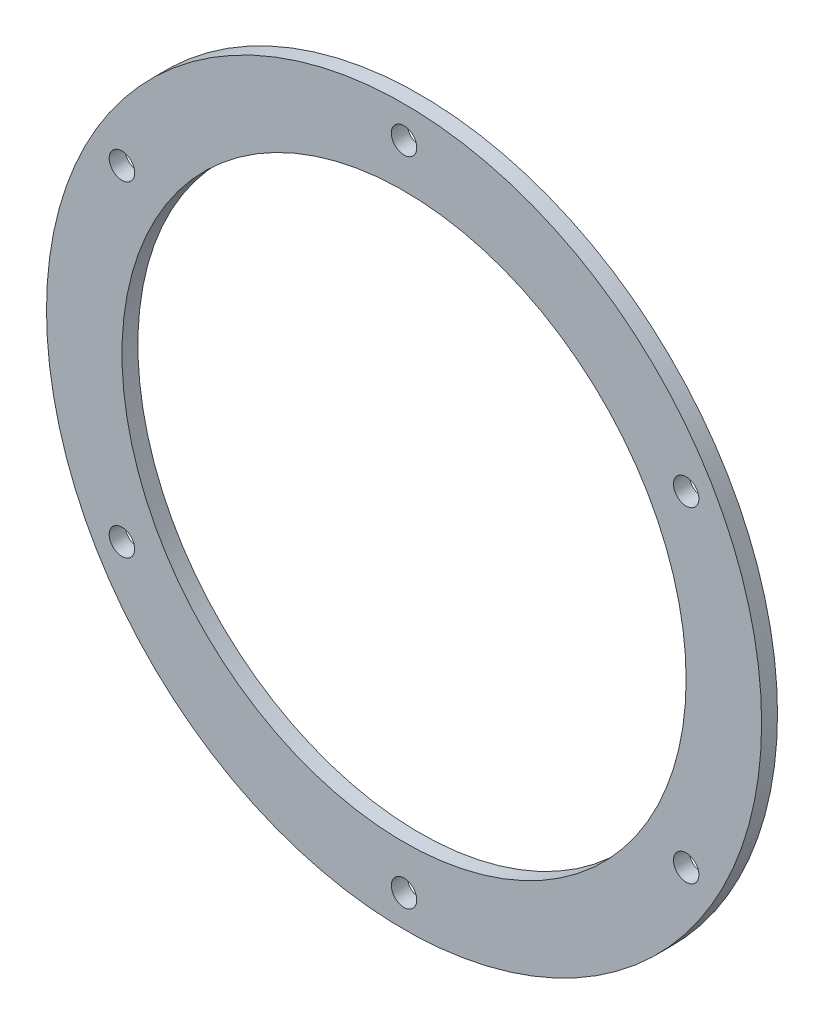
ISO-10303-21;
HEADER;
FILE_DESCRIPTION(('STEP AP214'),'2;1');
FILE_NAME('part.step','',(''),(''),'','','');
FILE_SCHEMA(('AUTOMOTIVE_DESIGN { 1 0 10303 214 1 1 1 1 }'));
ENDSEC;
DATA;
#1=APPLICATION_CONTEXT('core data for automotive mechanical design processes');
#2=APPLICATION_PROTOCOL_DEFINITION('international standard','automotive_design',2000,#1);
#3=PRODUCT_CONTEXT('',#1,'mechanical');
#4=PRODUCT('Part','Part','',(#3));
#5=PRODUCT_RELATED_PRODUCT_CATEGORY('part','',(#4));
#6=PRODUCT_DEFINITION_FORMATION('','',#4);
#7=PRODUCT_DEFINITION_CONTEXT('part definition',#1,'design');
#8=PRODUCT_DEFINITION('design','',#6,#7);
#9=PRODUCT_DEFINITION_SHAPE('','',#8);
#10=(LENGTH_UNIT() NAMED_UNIT(*) SI_UNIT(.MILLI.,.METRE.));
#11=(NAMED_UNIT(*) PLANE_ANGLE_UNIT() SI_UNIT($,.RADIAN.));
#12=(NAMED_UNIT(*) SI_UNIT($,.STERADIAN.) SOLID_ANGLE_UNIT());
#13=UNCERTAINTY_MEASURE_WITH_UNIT(LENGTH_MEASURE(1.E-05),#10,'distance_accuracy_value','');
#14=(GEOMETRIC_REPRESENTATION_CONTEXT(3) GLOBAL_UNCERTAINTY_ASSIGNED_CONTEXT((#13)) GLOBAL_UNIT_ASSIGNED_CONTEXT((#10,
#11,#12)) REPRESENTATION_CONTEXT('',''));
#15=CARTESIAN_POINT('',(0.,0.,0.));
#16=DIRECTION('',(0.,0.,1.));
#17=DIRECTION('',(1.,0.,0.));
#18=AXIS2_PLACEMENT_3D('',#15,#16,#17);
#19=CARTESIAN_POINT('',(0.,0.,2.));
#20=DIRECTION('',(0.,0.,1.));
#21=DIRECTION('',(1.,0.,0.));
#22=AXIS2_PLACEMENT_3D('',#19,#20,#21);
#23=PLANE('',#22);
#24=CARTESIAN_POINT('',(-35.507041555162,-20.5,2.));
#25=DIRECTION('',(0.,0.,1.));
#26=DIRECTION('',(1.,0.,0.));
#27=AXIS2_PLACEMENT_3D('',#24,#25,#26);
#28=CIRCLE('',#27,1.59999999999999);
#29=CARTESIAN_POINT('',(-33.907041555162,-20.5,2.));
#30=VERTEX_POINT('',#29);
#31=EDGE_CURVE('E72',#30,#30,#28,.T.);
#32=ORIENTED_EDGE('',*,*,#31,.F.);
#33=EDGE_LOOP('',(#32));
#34=FACE_BOUND('',#33,.T.);
#35=CARTESIAN_POINT('',(35.507041555162,-20.5,2.));
#36=DIRECTION('',(0.,0.,1.));
#37=DIRECTION('',(1.,0.,0.));
#38=AXIS2_PLACEMENT_3D('',#35,#36,#37);
#39=CIRCLE('',#38,1.6);
#40=CARTESIAN_POINT('',(37.107041555162,-20.5,2.));
#41=VERTEX_POINT('',#40);
#42=EDGE_CURVE('E60',#41,#41,#39,.T.);
#43=ORIENTED_EDGE('',*,*,#42,.F.);
#44=EDGE_LOOP('',(#43));
#45=FACE_BOUND('',#44,.T.);
#46=CARTESIAN_POINT('',(0.,41.,2.));
#47=DIRECTION('',(0.,0.,1.));
#48=DIRECTION('',(1.,0.,0.));
#49=AXIS2_PLACEMENT_3D('',#46,#47,#48);
#50=CIRCLE('',#49,1.6);
#51=CARTESIAN_POINT('',(1.6,41.,2.));
#52=VERTEX_POINT('',#51);
#53=EDGE_CURVE('E48',#52,#52,#50,.T.);
#54=ORIENTED_EDGE('',*,*,#53,.F.);
#55=EDGE_LOOP('',(#54));
#56=FACE_BOUND('',#55,.T.);
#57=CARTESIAN_POINT('',(0.,0.,2.));
#58=DIRECTION('',(0.,0.,1.));
#59=DIRECTION('',(1.,0.,0.));
#60=AXIS2_PLACEMENT_3D('',#57,#58,#59);
#61=CIRCLE('',#60,45.);
#62=CARTESIAN_POINT('',(45.,0.,2.));
#63=VERTEX_POINT('',#62);
#64=EDGE_CURVE('E10',#63,#63,#61,.T.);
#65=ORIENTED_EDGE('',*,*,#64,.T.);
#66=EDGE_LOOP('',(#65));
#67=FACE_BOUND('',#66,.T.);
#68=CARTESIAN_POINT('',(0.,0.,2.));
#69=DIRECTION('',(0.,0.,1.));
#70=DIRECTION('',(1.,0.,0.));
#71=AXIS2_PLACEMENT_3D('',#68,#69,#70);
#72=CIRCLE('',#71,35.5);
#73=CARTESIAN_POINT('',(35.5,0.,2.));
#74=VERTEX_POINT('',#73);
#75=EDGE_CURVE('E43',#74,#74,#72,.T.);
#76=ORIENTED_EDGE('',*,*,#75,.F.);
#77=EDGE_LOOP('',(#76));
#78=FACE_BOUND('',#77,.T.);
#79=CARTESIAN_POINT('',(35.507041555162,20.5,2.));
#80=DIRECTION('',(0.,0.,1.));
#81=DIRECTION('',(1.,0.,0.));
#82=AXIS2_PLACEMENT_3D('',#79,#80,#81);
#83=CIRCLE('',#82,1.6);
#84=CARTESIAN_POINT('',(37.107041555162,20.5,2.));
#85=VERTEX_POINT('',#84);
#86=EDGE_CURVE('E54',#85,#85,#83,.T.);
#87=ORIENTED_EDGE('',*,*,#86,.F.);
#88=EDGE_LOOP('',(#87));
#89=FACE_BOUND('',#88,.T.);
#90=CARTESIAN_POINT('',(0.,-41.,2.));
#91=DIRECTION('',(0.,0.,1.));
#92=DIRECTION('',(1.,0.,0.));
#93=AXIS2_PLACEMENT_3D('',#90,#91,#92);
#94=CIRCLE('',#93,1.6);
#95=CARTESIAN_POINT('',(1.60000000000001,-41.,2.));
#96=VERTEX_POINT('',#95);
#97=EDGE_CURVE('E66',#96,#96,#94,.T.);
#98=ORIENTED_EDGE('',*,*,#97,.F.);
#99=EDGE_LOOP('',(#98));
#100=FACE_BOUND('',#99,.T.);
#101=CARTESIAN_POINT('',(-35.507041555162,20.5,2.));
#102=DIRECTION('',(0.,0.,1.));
#103=DIRECTION('',(1.,0.,0.));
#104=AXIS2_PLACEMENT_3D('',#101,#102,#103);
#105=CIRCLE('',#104,1.6);
#106=CARTESIAN_POINT('',(-33.907041555162,20.5,2.));
#107=VERTEX_POINT('',#106);
#108=EDGE_CURVE('E78',#107,#107,#105,.T.);
#109=ORIENTED_EDGE('',*,*,#108,.F.);
#110=EDGE_LOOP('',(#109));
#111=FACE_BOUND('',#110,.T.);
#112=ADVANCED_FACE('F32',(#34,#45,#56,#67,#78,#89,#100,#111),#23,.T.);
#113=CARTESIAN_POINT('',(0.,0.,0.));
#114=DIRECTION('',(0.,0.,1.));
#115=DIRECTION('',(1.,0.,0.));
#116=AXIS2_PLACEMENT_3D('',#113,#114,#115);
#117=PLANE('',#116);
#118=CARTESIAN_POINT('',(0.,0.,0.));
#119=DIRECTION('',(0.,0.,1.));
#120=DIRECTION('',(1.,0.,0.));
#121=AXIS2_PLACEMENT_3D('',#118,#119,#120);
#122=CIRCLE('',#121,45.);
#123=CARTESIAN_POINT('',(45.,0.,0.));
#124=VERTEX_POINT('',#123);
#125=EDGE_CURVE('E36',#124,#124,#122,.T.);
#126=ORIENTED_EDGE('',*,*,#125,.F.);
#127=EDGE_LOOP('',(#126));
#128=FACE_BOUND('',#127,.T.);
#129=CARTESIAN_POINT('',(0.,0.,0.));
#130=DIRECTION('',(0.,0.,1.));
#131=DIRECTION('',(1.,0.,0.));
#132=AXIS2_PLACEMENT_3D('',#129,#130,#131);
#133=CIRCLE('',#132,35.5);
#134=CARTESIAN_POINT('',(35.5,0.,0.));
#135=VERTEX_POINT('',#134);
#136=EDGE_CURVE('E45',#135,#135,#133,.T.);
#137=ORIENTED_EDGE('',*,*,#136,.T.);
#138=EDGE_LOOP('',(#137));
#139=FACE_BOUND('',#138,.T.);
#140=CARTESIAN_POINT('',(0.,41.,0.));
#141=DIRECTION('',(0.,0.,1.));
#142=DIRECTION('',(1.,0.,0.));
#143=AXIS2_PLACEMENT_3D('',#140,#141,#142);
#144=CIRCLE('',#143,1.6);
#145=CARTESIAN_POINT('',(1.6,41.,0.));
#146=VERTEX_POINT('',#145);
#147=EDGE_CURVE('E51',#146,#146,#144,.T.);
#148=ORIENTED_EDGE('',*,*,#147,.T.);
#149=EDGE_LOOP('',(#148));
#150=FACE_BOUND('',#149,.T.);
#151=CARTESIAN_POINT('',(35.507041555162,20.5,0.));
#152=DIRECTION('',(0.,0.,1.));
#153=DIRECTION('',(1.,0.,0.));
#154=AXIS2_PLACEMENT_3D('',#151,#152,#153);
#155=CIRCLE('',#154,1.6);
#156=CARTESIAN_POINT('',(37.107041555162,20.5,0.));
#157=VERTEX_POINT('',#156);
#158=EDGE_CURVE('E57',#157,#157,#155,.T.);
#159=ORIENTED_EDGE('',*,*,#158,.T.);
#160=EDGE_LOOP('',(#159));
#161=FACE_BOUND('',#160,.T.);
#162=CARTESIAN_POINT('',(35.507041555162,-20.5,0.));
#163=DIRECTION('',(0.,0.,1.));
#164=DIRECTION('',(1.,0.,0.));
#165=AXIS2_PLACEMENT_3D('',#162,#163,#164);
#166=CIRCLE('',#165,1.6);
#167=CARTESIAN_POINT('',(37.107041555162,-20.5,0.));
#168=VERTEX_POINT('',#167);
#169=EDGE_CURVE('E63',#168,#168,#166,.T.);
#170=ORIENTED_EDGE('',*,*,#169,.T.);
#171=EDGE_LOOP('',(#170));
#172=FACE_BOUND('',#171,.T.);
#173=CARTESIAN_POINT('',(0.,-41.,0.));
#174=DIRECTION('',(0.,0.,1.));
#175=DIRECTION('',(1.,0.,0.));
#176=AXIS2_PLACEMENT_3D('',#173,#174,#175);
#177=CIRCLE('',#176,1.6);
#178=CARTESIAN_POINT('',(1.60000000000001,-41.,0.));
#179=VERTEX_POINT('',#178);
#180=EDGE_CURVE('E69',#179,#179,#177,.T.);
#181=ORIENTED_EDGE('',*,*,#180,.T.);
#182=EDGE_LOOP('',(#181));
#183=FACE_BOUND('',#182,.T.);
#184=CARTESIAN_POINT('',(-35.507041555162,-20.5,0.));
#185=DIRECTION('',(0.,0.,1.));
#186=DIRECTION('',(1.,0.,0.));
#187=AXIS2_PLACEMENT_3D('',#184,#185,#186);
#188=CIRCLE('',#187,1.59999999999999);
#189=CARTESIAN_POINT('',(-33.907041555162,-20.5,0.));
#190=VERTEX_POINT('',#189);
#191=EDGE_CURVE('E75',#190,#190,#188,.T.);
#192=ORIENTED_EDGE('',*,*,#191,.T.);
#193=EDGE_LOOP('',(#192));
#194=FACE_BOUND('',#193,.T.);
#195=CARTESIAN_POINT('',(-35.507041555162,20.5,0.));
#196=DIRECTION('',(0.,0.,1.));
#197=DIRECTION('',(1.,0.,0.));
#198=AXIS2_PLACEMENT_3D('',#195,#196,#197);
#199=CIRCLE('',#198,1.6);
#200=CARTESIAN_POINT('',(-33.907041555162,20.5,0.));
#201=VERTEX_POINT('',#200);
#202=EDGE_CURVE('E81',#201,#201,#199,.T.);
#203=ORIENTED_EDGE('',*,*,#202,.T.);
#204=EDGE_LOOP('',(#203));
#205=FACE_BOUND('',#204,.T.);
#206=ADVANCED_FACE('F91',(#128,#139,#150,#161,#172,#183,#194,#205),#117,.F.);
#207=CARTESIAN_POINT('',(0.,0.,2.));
#208=DIRECTION('',(0.,0.,-1.));
#209=DIRECTION('',(-1.,0.,0.));
#210=AXIS2_PLACEMENT_3D('',#207,#208,#209);
#211=CYLINDRICAL_SURFACE('',#210,45.);
#212=ORIENTED_EDGE('',*,*,#64,.F.);
#213=EDGE_LOOP('',(#212));
#214=FACE_BOUND('',#213,.T.);
#215=ORIENTED_EDGE('',*,*,#125,.T.);
#216=EDGE_LOOP('',(#215));
#217=FACE_BOUND('',#216,.T.);
#218=ADVANCED_FACE('F34',(#214,#217),#211,.T.);
#219=CARTESIAN_POINT('',(0.,0.,2.));
#220=DIRECTION('',(0.,0.,-1.));
#221=DIRECTION('',(-1.,0.,0.));
#222=AXIS2_PLACEMENT_3D('',#219,#220,#221);
#223=CYLINDRICAL_SURFACE('',#222,35.5);
#224=ORIENTED_EDGE('',*,*,#75,.T.);
#225=EDGE_LOOP('',(#224));
#226=FACE_BOUND('',#225,.T.);
#227=ORIENTED_EDGE('',*,*,#136,.F.);
#228=EDGE_LOOP('',(#227));
#229=FACE_BOUND('',#228,.T.);
#230=ADVANCED_FACE('F101',(#226,#229),#223,.F.);
#231=CARTESIAN_POINT('',(0.,41.,2.));
#232=DIRECTION('',(0.,0.,-1.));
#233=DIRECTION('',(-1.,0.,0.));
#234=AXIS2_PLACEMENT_3D('',#231,#232,#233);
#235=CYLINDRICAL_SURFACE('',#234,1.6);
#236=ORIENTED_EDGE('',*,*,#53,.T.);
#237=EDGE_LOOP('',(#236));
#238=FACE_BOUND('',#237,.T.);
#239=ORIENTED_EDGE('',*,*,#147,.F.);
#240=EDGE_LOOP('',(#239));
#241=FACE_BOUND('',#240,.T.);
#242=ADVANCED_FACE('F104',(#238,#241),#235,.F.);
#243=CARTESIAN_POINT('',(35.507041555162,20.5,2.));
#244=DIRECTION('',(0.,0.,-1.));
#245=DIRECTION('',(-1.,0.,0.));
#246=AXIS2_PLACEMENT_3D('',#243,#244,#245);
#247=CYLINDRICAL_SURFACE('',#246,1.6);
#248=ORIENTED_EDGE('',*,*,#86,.T.);
#249=EDGE_LOOP('',(#248));
#250=FACE_BOUND('',#249,.T.);
#251=ORIENTED_EDGE('',*,*,#158,.F.);
#252=EDGE_LOOP('',(#251));
#253=FACE_BOUND('',#252,.T.);
#254=ADVANCED_FACE('F108',(#250,#253),#247,.F.);
#255=CARTESIAN_POINT('',(35.507041555162,-20.5,2.));
#256=DIRECTION('',(0.,0.,-1.));
#257=DIRECTION('',(-1.,0.,0.));
#258=AXIS2_PLACEMENT_3D('',#255,#256,#257);
#259=CYLINDRICAL_SURFACE('',#258,1.6);
#260=ORIENTED_EDGE('',*,*,#42,.T.);
#261=EDGE_LOOP('',(#260));
#262=FACE_BOUND('',#261,.T.);
#263=ORIENTED_EDGE('',*,*,#169,.F.);
#264=EDGE_LOOP('',(#263));
#265=FACE_BOUND('',#264,.T.);
#266=ADVANCED_FACE('F112',(#262,#265),#259,.F.);
#267=CARTESIAN_POINT('',(0.,-41.,2.));
#268=DIRECTION('',(0.,0.,-1.));
#269=DIRECTION('',(-1.,0.,0.));
#270=AXIS2_PLACEMENT_3D('',#267,#268,#269);
#271=CYLINDRICAL_SURFACE('',#270,1.6);
#272=ORIENTED_EDGE('',*,*,#97,.T.);
#273=EDGE_LOOP('',(#272));
#274=FACE_BOUND('',#273,.T.);
#275=ORIENTED_EDGE('',*,*,#180,.F.);
#276=EDGE_LOOP('',(#275));
#277=FACE_BOUND('',#276,.T.);
#278=ADVANCED_FACE('F116',(#274,#277),#271,.F.);
#279=CARTESIAN_POINT('',(-35.507041555162,-20.5,2.));
#280=DIRECTION('',(0.,0.,-1.));
#281=DIRECTION('',(-1.,0.,0.));
#282=AXIS2_PLACEMENT_3D('',#279,#280,#281);
#283=CYLINDRICAL_SURFACE('',#282,1.59999999999999);
#284=ORIENTED_EDGE('',*,*,#31,.T.);
#285=EDGE_LOOP('',(#284));
#286=FACE_BOUND('',#285,.T.);
#287=ORIENTED_EDGE('',*,*,#191,.F.);
#288=EDGE_LOOP('',(#287));
#289=FACE_BOUND('',#288,.T.);
#290=ADVANCED_FACE('F120',(#286,#289),#283,.F.);
#291=CARTESIAN_POINT('',(-35.507041555162,20.5,2.));
#292=DIRECTION('',(0.,0.,-1.));
#293=DIRECTION('',(-1.,0.,0.));
#294=AXIS2_PLACEMENT_3D('',#291,#292,#293);
#295=CYLINDRICAL_SURFACE('',#294,1.6);
#296=ORIENTED_EDGE('',*,*,#108,.T.);
#297=EDGE_LOOP('',(#296));
#298=FACE_BOUND('',#297,.T.);
#299=ORIENTED_EDGE('',*,*,#202,.F.);
#300=EDGE_LOOP('',(#299));
#301=FACE_BOUND('',#300,.T.);
#302=ADVANCED_FACE('F87',(#298,#301),#295,.F.);
#303=CLOSED_SHELL('',(#112,#206,#218,#230,#242,#254,#266,#278,#290,#302));
#304=MANIFOLD_SOLID_BREP('B2',#303);
#305=ADVANCED_BREP_SHAPE_REPRESENTATION('',(#18,#304),#14);
#306=SHAPE_DEFINITION_REPRESENTATION(#9,#305);
ENDSEC;
END-ISO-10303-21;
